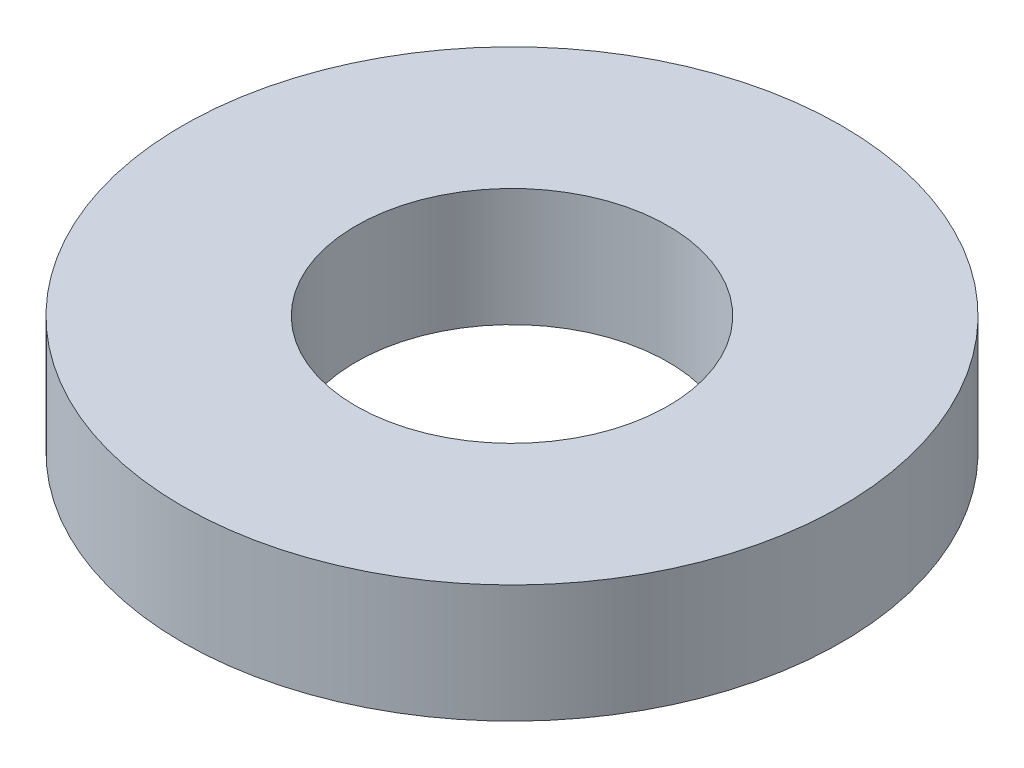
ISO-10303-21;
HEADER;
FILE_DESCRIPTION(('STEP AP214'),'2;1');
FILE_NAME('part.step','',(''),(''),'','','');
FILE_SCHEMA(('AUTOMOTIVE_DESIGN { 1 0 10303 214 1 1 1 1 }'));
ENDSEC;
DATA;
#1=APPLICATION_CONTEXT('core data for automotive mechanical design processes');
#2=APPLICATION_PROTOCOL_DEFINITION('international standard','automotive_design',2000,#1);
#3=PRODUCT_CONTEXT('',#1,'mechanical');
#4=PRODUCT('Part','Part','',(#3));
#5=PRODUCT_RELATED_PRODUCT_CATEGORY('part','',(#4));
#6=PRODUCT_DEFINITION_FORMATION('','',#4);
#7=PRODUCT_DEFINITION_CONTEXT('part definition',#1,'design');
#8=PRODUCT_DEFINITION('design','',#6,#7);
#9=PRODUCT_DEFINITION_SHAPE('','',#8);
#10=(LENGTH_UNIT() NAMED_UNIT(*) SI_UNIT(.MILLI.,.METRE.));
#11=(NAMED_UNIT(*) PLANE_ANGLE_UNIT() SI_UNIT($,.RADIAN.));
#12=(NAMED_UNIT(*) SI_UNIT($,.STERADIAN.) SOLID_ANGLE_UNIT());
#13=UNCERTAINTY_MEASURE_WITH_UNIT(LENGTH_MEASURE(1.E-05),#10,'distance_accuracy_value','');
#14=(GEOMETRIC_REPRESENTATION_CONTEXT(3) GLOBAL_UNCERTAINTY_ASSIGNED_CONTEXT((#13)) GLOBAL_UNIT_ASSIGNED_CONTEXT((#10,
#11,#12)) REPRESENTATION_CONTEXT('',''));
#15=CARTESIAN_POINT('',(0.,0.,0.));
#16=DIRECTION('',(0.,0.,1.));
#17=DIRECTION('',(1.,0.,0.));
#18=AXIS2_PLACEMENT_3D('',#15,#16,#17);
#19=CARTESIAN_POINT('',(0.,17.,0.));
#20=DIRECTION('',(0.,-1.,0.));
#21=DIRECTION('',(0.,0.,-1.));
#22=AXIS2_PLACEMENT_3D('',#19,#20,#21);
#23=CYLINDRICAL_SURFACE('',#22,47.5);
#24=CARTESIAN_POINT('',(0.,17.,0.));
#25=DIRECTION('',(0.,1.,0.));
#26=DIRECTION('',(0.,0.,1.));
#27=AXIS2_PLACEMENT_3D('',#24,#25,#26);
#28=CIRCLE('',#27,47.5);
#29=CARTESIAN_POINT('',(0.,17.,47.5));
#30=VERTEX_POINT('',#29);
#31=EDGE_CURVE('E10',#30,#30,#28,.T.);
#32=ORIENTED_EDGE('',*,*,#31,.F.);
#33=EDGE_LOOP('',(#32));
#34=FACE_BOUND('',#33,.T.);
#35=CARTESIAN_POINT('',(0.,0.,0.));
#36=DIRECTION('',(0.,1.,0.));
#37=DIRECTION('',(0.,0.,1.));
#38=AXIS2_PLACEMENT_3D('',#35,#36,#37);
#39=CIRCLE('',#38,47.5);
#40=CARTESIAN_POINT('',(0.,0.,47.5));
#41=VERTEX_POINT('',#40);
#42=EDGE_CURVE('E37',#41,#41,#39,.T.);
#43=ORIENTED_EDGE('',*,*,#42,.T.);
#44=EDGE_LOOP('',(#43));
#45=FACE_BOUND('',#44,.T.);
#46=ADVANCED_FACE('F40',(#34,#45),#23,.T.);
#47=CARTESIAN_POINT('',(0.,17.,0.));
#48=DIRECTION('',(0.,1.,0.));
#49=DIRECTION('',(0.,0.,1.));
#50=AXIS2_PLACEMENT_3D('',#47,#48,#49);
#51=PLANE('',#50);
#52=CARTESIAN_POINT('',(0.,17.,0.));
#53=DIRECTION('',(0.,1.,0.));
#54=DIRECTION('',(0.,0.,1.));
#55=AXIS2_PLACEMENT_3D('',#52,#53,#54);
#56=CIRCLE('',#55,22.5);
#57=CARTESIAN_POINT('',(0.,17.,22.5));
#58=VERTEX_POINT('',#57);
#59=EDGE_CURVE('E50',#58,#58,#56,.T.);
#60=ORIENTED_EDGE('',*,*,#59,.F.);
#61=EDGE_LOOP('',(#60));
#62=FACE_BOUND('',#61,.T.);
#63=ORIENTED_EDGE('',*,*,#31,.T.);
#64=EDGE_LOOP('',(#63));
#65=FACE_BOUND('',#64,.T.);
#66=ADVANCED_FACE('F59',(#62,#65),#51,.T.);
#67=CARTESIAN_POINT('',(0.,0.,0.));
#68=DIRECTION('',(0.,1.,0.));
#69=DIRECTION('',(0.,0.,1.));
#70=AXIS2_PLACEMENT_3D('',#67,#68,#69);
#71=PLANE('',#70);
#72=CARTESIAN_POINT('',(0.,0.,0.));
#73=DIRECTION('',(0.,1.,0.));
#74=DIRECTION('',(0.,0.,1.));
#75=AXIS2_PLACEMENT_3D('',#72,#73,#74);
#76=CIRCLE('',#75,22.5);
#77=CARTESIAN_POINT('',(0.,0.,22.5));
#78=VERTEX_POINT('',#77);
#79=EDGE_CURVE('E47',#78,#78,#76,.T.);
#80=ORIENTED_EDGE('',*,*,#79,.T.);
#81=EDGE_LOOP('',(#80));
#82=FACE_BOUND('',#81,.T.);
#83=ORIENTED_EDGE('',*,*,#42,.F.);
#84=EDGE_LOOP('',(#83));
#85=FACE_BOUND('',#84,.T.);
#86=ADVANCED_FACE('F58',(#82,#85),#71,.F.);
#87=CARTESIAN_POINT('',(0.,17.,0.));
#88=DIRECTION('',(0.,-1.,0.));
#89=DIRECTION('',(0.,0.,-1.));
#90=AXIS2_PLACEMENT_3D('',#87,#88,#89);
#91=CYLINDRICAL_SURFACE('',#90,22.5);
#92=ORIENTED_EDGE('',*,*,#59,.T.);
#93=EDGE_LOOP('',(#92));
#94=FACE_BOUND('',#93,.T.);
#95=ORIENTED_EDGE('',*,*,#79,.F.);
#96=EDGE_LOOP('',(#95));
#97=FACE_BOUND('',#96,.T.);
#98=ADVANCED_FACE('F54',(#94,#97),#91,.F.);
#99=CLOSED_SHELL('',(#46,#66,#86,#98));
#100=MANIFOLD_SOLID_BREP('B2',#99);
#101=ADVANCED_BREP_SHAPE_REPRESENTATION('',(#18,#100),#14);
#102=SHAPE_DEFINITION_REPRESENTATION(#9,#101);
ENDSEC;
END-ISO-10303-21;
